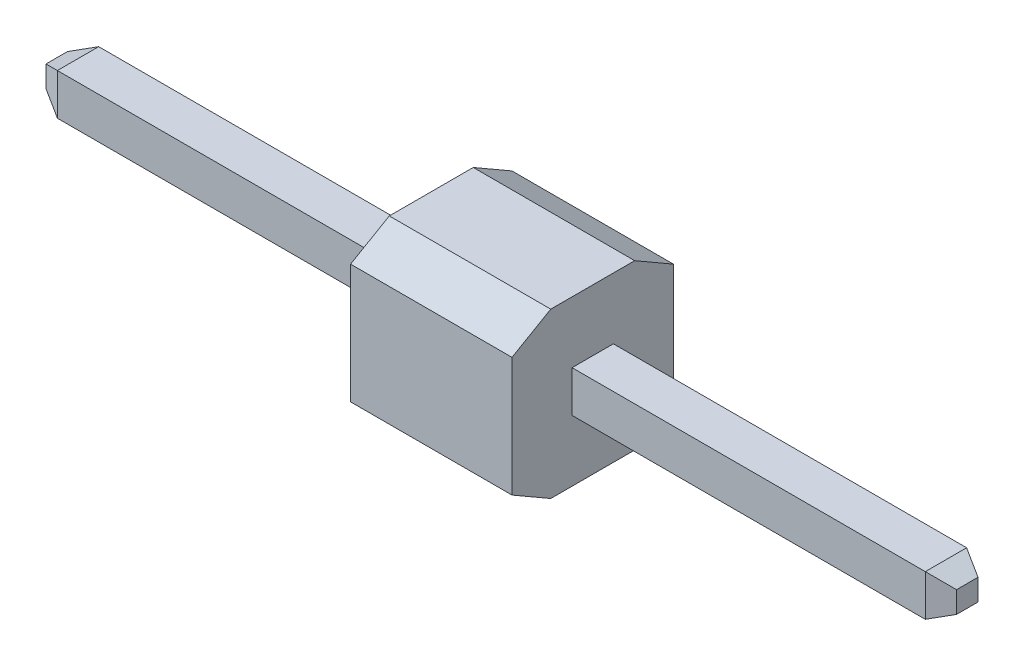
ISO-10303-21;
HEADER;
FILE_DESCRIPTION(('STEP AP214'),'2;1');
FILE_NAME('part.step','',(''),(''),'','','');
FILE_SCHEMA(('AUTOMOTIVE_DESIGN { 1 0 10303 214 1 1 1 1 }'));
ENDSEC;
DATA;
#1=APPLICATION_CONTEXT('core data for automotive mechanical design processes');
#2=APPLICATION_PROTOCOL_DEFINITION('international standard','automotive_design',2000,#1);
#3=PRODUCT_CONTEXT('',#1,'mechanical');
#4=PRODUCT('Part','Part','',(#3));
#5=PRODUCT_RELATED_PRODUCT_CATEGORY('part','',(#4));
#6=PRODUCT_DEFINITION_FORMATION('','',#4);
#7=PRODUCT_DEFINITION_CONTEXT('part definition',#1,'design');
#8=PRODUCT_DEFINITION('design','',#6,#7);
#9=PRODUCT_DEFINITION_SHAPE('','',#8);
#10=(LENGTH_UNIT() NAMED_UNIT(*) SI_UNIT(.MILLI.,.METRE.));
#11=(NAMED_UNIT(*) PLANE_ANGLE_UNIT() SI_UNIT($,.RADIAN.));
#12=(NAMED_UNIT(*) SI_UNIT($,.STERADIAN.) SOLID_ANGLE_UNIT());
#13=UNCERTAINTY_MEASURE_WITH_UNIT(LENGTH_MEASURE(1.E-05),#10,'distance_accuracy_value','');
#14=(GEOMETRIC_REPRESENTATION_CONTEXT(3) GLOBAL_UNCERTAINTY_ASSIGNED_CONTEXT((#13)) GLOBAL_UNIT_ASSIGNED_CONTEXT((#10,
#11,#12)) REPRESENTATION_CONTEXT('',''));
#15=CARTESIAN_POINT('',(0.,0.,0.));
#16=DIRECTION('',(0.,0.,1.));
#17=DIRECTION('',(1.,0.,0.));
#18=AXIS2_PLACEMENT_3D('',#15,#16,#17);
#19=CARTESIAN_POINT('',(5.42105015001378,-0.317128262913911,0.629998634255617));
#20=DIRECTION('',(1.,4.37113882867379E-08,-4.37113882867379E-08));
#21=DIRECTION('',(-4.37113882867379E-08,1.,0.));
#22=AXIS2_PLACEMENT_3D('',#19,#20,#21);
#23=PLANE('',#22);
#24=DIRECTION('',(1.59994777304463E-08,0.500000000000192,0.866025403784328));
#25=VECTOR('',#24,1.);
#26=CARTESIAN_POINT('',(5.42105002702786,0.926461575576084,-0.940001365744382));
#27=LINE('',#26,#25);
#28=CARTESIAN_POINT('',(5.42105002702786,0.926461575576084,-0.940001365744382));
#29=VERTEX_POINT('',#28);
#30=CARTESIAN_POINT('',(5.42105003811263,1.27287173708609,-0.340001365744383));
#31=VERTEX_POINT('',#30);
#32=EDGE_CURVE('E11',#29,#31,#27,.T.);
#33=ORIENTED_EDGE('',*,*,#32,.T.);
#34=DIRECTION('',(4.37113886966664E-08,0.,0.999999999999999));
#35=VECTOR('',#34,1.);
#36=CARTESIAN_POINT('',(5.42105003811263,1.27287173708609,-0.340001365744383));
#37=LINE('',#36,#35);
#38=CARTESIAN_POINT('',(5.42105009493743,1.27287173708609,0.959998634255618));
#39=VERTEX_POINT('',#38);
#40=EDGE_CURVE('E304',#31,#39,#37,.T.);
#41=ORIENTED_EDGE('',*,*,#40,.T.);
#42=DIRECTION('',(5.9710866882576E-08,-0.500000000000187,0.866025403784329));
#43=VECTOR('',#42,1.);
#44=CARTESIAN_POINT('',(5.42105009493743,1.27287173708609,0.959998634255618));
#45=LINE('',#44,#43);
#46=CARTESIAN_POINT('',(5.42105013630633,0.92646157557609,1.55999863425562));
#47=VERTEX_POINT('',#46);
#48=EDGE_CURVE('E296',#39,#47,#45,.T.);
#49=ORIENTED_EDGE('',*,*,#48,.T.);
#50=DIRECTION('',(4.37113884815545E-08,-0.999999999999999,0.));
#51=VECTOR('',#50,1.);
#52=CARTESIAN_POINT('',(5.42105013630633,0.92646157557609,1.55999863425562));
#53=LINE('',#52,#51);
#54=CARTESIAN_POINT('',(5.42105021704912,-0.920718101393911,1.55999863425562));
#55=VERTEX_POINT('',#54);
#56=EDGE_CURVE('E281',#47,#55,#53,.T.);
#57=ORIENTED_EDGE('',*,*,#56,.T.);
#58=DIRECTION('',(1.5999479012306E-08,0.500000000000192,0.866025403784328));
#59=VECTOR('',#58,1.);
#60=CARTESIAN_POINT('',(5.42105020596436,-1.26712826291391,0.959998634255618));
#61=LINE('',#60,#59);
#62=CARTESIAN_POINT('',(5.42105020596436,-1.26712826291391,0.959998634255618));
#63=VERTEX_POINT('',#62);
#64=EDGE_CURVE('E265',#63,#55,#61,.T.);
#65=ORIENTED_EDGE('',*,*,#64,.F.);
#66=DIRECTION('',(4.37113886966664E-08,0.,0.999999999999999));
#67=VECTOR('',#66,1.);
#68=CARTESIAN_POINT('',(5.42105014913955,-1.26712826291391,-0.340001365744383));
#69=LINE('',#68,#67);
#70=CARTESIAN_POINT('',(5.42105014913955,-1.26712826291391,-0.340001365744383));
#71=VERTEX_POINT('',#70);
#72=EDGE_CURVE('E248',#71,#63,#69,.T.);
#73=ORIENTED_EDGE('',*,*,#72,.F.);
#74=DIRECTION('',(5.97108656001699E-08,-0.500000000000189,0.866025403784328));
#75=VECTOR('',#74,1.);
#76=CARTESIAN_POINT('',(5.42105010777065,-0.920718101393916,-0.940001365744382));
#77=LINE('',#76,#75);
#78=CARTESIAN_POINT('',(5.42105010777065,-0.920718101393916,-0.940001365744382));
#79=VERTEX_POINT('',#78);
#80=EDGE_CURVE('E242',#79,#71,#77,.T.);
#81=ORIENTED_EDGE('',*,*,#80,.F.);
#82=DIRECTION('',(4.37113884815545E-08,-0.999999999999999,0.));
#83=VECTOR('',#82,1.);
#84=CARTESIAN_POINT('',(5.42105002702786,0.926461575576084,-0.940001365744382));
#85=LINE('',#84,#83);
#86=EDGE_CURVE('E236',#29,#79,#85,.T.);
#87=ORIENTED_EDGE('',*,*,#86,.F.);
#88=EDGE_LOOP('',(#33,#41,#49,#57,#65,#73,#81,#87));
#89=FACE_BOUND('',#88,.T.);
#90=DIRECTION('',(-4.37113886753159E-08,0.,-0.999999999999999));
#91=VECTOR('',#90,1.);
#92=CARTESIAN_POINT('',(5.42105012203849,0.322871737086087,0.629998634255617));
#93=LINE('',#92,#91);
#94=CARTESIAN_POINT('',(5.42105012203849,0.322871737086087,0.629998634255617));
#95=VERTEX_POINT('',#94);
#96=CARTESIAN_POINT('',(5.4210500940632,0.322871737086086,-0.0100013657443826));
#97=VERTEX_POINT('',#96);
#98=EDGE_CURVE('E302',#95,#97,#93,.T.);
#99=ORIENTED_EDGE('',*,*,#98,.T.);
#100=DIRECTION('',(-4.3711388675316E-08,0.999999999999999,0.));
#101=VECTOR('',#100,1.);
#102=CARTESIAN_POINT('',(5.42105012203849,-0.317128262913913,-0.0100013657443826));
#103=LINE('',#102,#101);
#104=CARTESIAN_POINT('',(5.42105012203849,-0.317128262913913,-0.0100013657443826));
#105=VERTEX_POINT('',#104);
#106=EDGE_CURVE('E293',#105,#97,#103,.T.);
#107=ORIENTED_EDGE('',*,*,#106,.F.);
#108=DIRECTION('',(-4.37113886753159E-08,0.,-0.999999999999999));
#109=VECTOR('',#108,1.);
#110=CARTESIAN_POINT('',(5.42105015001378,-0.317128262913911,0.629998634255617));
#111=LINE('',#110,#109);
#112=CARTESIAN_POINT('',(5.42105015001378,-0.317128262913911,0.629998634255617));
#113=VERTEX_POINT('',#112);
#114=EDGE_CURVE('E278',#113,#105,#111,.T.);
#115=ORIENTED_EDGE('',*,*,#114,.F.);
#116=DIRECTION('',(-4.3711388675316E-08,0.999999999999999,0.));
#117=VECTOR('',#116,1.);
#118=CARTESIAN_POINT('',(5.42105015001378,-0.317128262913911,0.629998634255617));
#119=LINE('',#118,#117);
#120=EDGE_CURVE('E263',#113,#95,#119,.T.);
#121=ORIENTED_EDGE('',*,*,#120,.T.);
#122=EDGE_LOOP('',(#99,#107,#115,#121));
#123=FACE_BOUND('',#122,.T.);
#124=ADVANCED_FACE('F17',(#89,#123),#23,.T.);
#125=CARTESIAN_POINT('',(2.92105015001378,-0.317128372192382,0.629998743534088));
#126=DIRECTION('',(1.,4.37113882867379E-08,-4.37113882867379E-08));
#127=DIRECTION('',(-4.37113882867379E-08,1.,0.));
#128=AXIS2_PLACEMENT_3D('',#125,#126,#127);
#129=PLANE('',#128);
#130=DIRECTION('',(1.59994783714339E-08,0.500000000000192,0.866025403784328));
#131=VECTOR('',#130,1.);
#132=CARTESIAN_POINT('',(2.92105002702786,0.926461466297614,-0.940001256465912));
#133=LINE('',#132,#131);
#134=CARTESIAN_POINT('',(2.92105002702786,0.926461466297614,-0.940001256465912));
#135=VERTEX_POINT('',#134);
#136=CARTESIAN_POINT('',(2.92105003811263,1.27287162780762,-0.340001256465912));
#137=VERTEX_POINT('',#136);
#138=EDGE_CURVE('E24',#135,#137,#133,.T.);
#139=ORIENTED_EDGE('',*,*,#138,.F.);
#140=DIRECTION('',(4.37113882411397E-08,-0.999999999999999,0.));
#141=VECTOR('',#140,1.);
#142=CARTESIAN_POINT('',(2.92105002702786,0.926461466297614,-0.940001256465912));
#143=LINE('',#142,#141);
#144=CARTESIAN_POINT('',(2.92105010777065,-0.920718210672387,-0.940001256465912));
#145=VERTEX_POINT('',#144);
#146=EDGE_CURVE('E300',#135,#145,#143,.T.);
#147=ORIENTED_EDGE('',*,*,#146,.T.);
#148=DIRECTION('',(5.97108668821451E-08,-0.500000000000189,0.866025403784328));
#149=VECTOR('',#148,1.);
#150=CARTESIAN_POINT('',(2.92105010777065,-0.920718210672387,-0.940001256465912));
#151=LINE('',#150,#149);
#152=CARTESIAN_POINT('',(2.92105014913955,-1.26712837219238,-0.340001256465912));
#153=VERTEX_POINT('',#152);
#154=EDGE_CURVE('E286',#145,#153,#151,.T.);
#155=ORIENTED_EDGE('',*,*,#154,.T.);
#156=DIRECTION('',(4.37113883550593E-08,0.,0.999999999999999));
#157=VECTOR('',#156,1.);
#158=CARTESIAN_POINT('',(2.92105014913955,-1.26712837219238,-0.340001256465912));
#159=LINE('',#158,#157);
#160=CARTESIAN_POINT('',(2.92105020596436,-1.26712837219238,0.959998743534088));
#161=VERTEX_POINT('',#160);
#162=EDGE_CURVE('E271',#153,#161,#159,.T.);
#163=ORIENTED_EDGE('',*,*,#162,.T.);
#164=DIRECTION('',(1.59994783713184E-08,0.500000000000192,0.866025403784328));
#165=VECTOR('',#164,1.);
#166=CARTESIAN_POINT('',(2.92105020596436,-1.26712837219238,0.959998743534088));
#167=LINE('',#166,#165);
#168=CARTESIAN_POINT('',(2.92105021704912,-0.920718210672382,1.55999874353409));
#169=VERTEX_POINT('',#168);
#170=EDGE_CURVE('E253',#161,#169,#167,.T.);
#171=ORIENTED_EDGE('',*,*,#170,.T.);
#172=DIRECTION('',(4.37113882411397E-08,-0.999999999999999,0.));
#173=VECTOR('',#172,1.);
#174=CARTESIAN_POINT('',(2.92105013630633,0.926461466297619,1.55999874353409));
#175=LINE('',#174,#173);
#176=CARTESIAN_POINT('',(2.92105013630633,0.926461466297619,1.55999874353409));
#177=VERTEX_POINT('',#176);
#178=EDGE_CURVE('E261',#177,#169,#175,.T.);
#179=ORIENTED_EDGE('',*,*,#178,.F.);
#180=DIRECTION('',(5.9710866882576E-08,-0.500000000000187,0.866025403784329));
#181=VECTOR('',#180,1.);
#182=CARTESIAN_POINT('',(2.92105009493743,1.27287162780762,0.959998743534088));
#183=LINE('',#182,#181);
#184=CARTESIAN_POINT('',(2.92105009493743,1.27287162780762,0.959998743534088));
#185=VERTEX_POINT('',#184);
#186=EDGE_CURVE('E276',#185,#177,#183,.T.);
#187=ORIENTED_EDGE('',*,*,#186,.F.);
#188=DIRECTION('',(4.37113883550593E-08,0.,0.999999999999999));
#189=VECTOR('',#188,1.);
#190=CARTESIAN_POINT('',(2.92105003811263,1.27287162780762,-0.340001256465912));
#191=LINE('',#190,#189);
#192=EDGE_CURVE('E291',#137,#185,#191,.T.);
#193=ORIENTED_EDGE('',*,*,#192,.F.);
#194=EDGE_LOOP('',(#139,#147,#155,#163,#171,#179,#187,#193));
#195=FACE_BOUND('',#194,.T.);
#196=DIRECTION('',(-4.3711388675316E-08,0.999999999999999,0.));
#197=VECTOR('',#196,1.);
#198=CARTESIAN_POINT('',(2.92105012203849,-0.317128372192384,-0.0100012564659119));
#199=LINE('',#198,#197);
#200=CARTESIAN_POINT('',(2.92105012203849,-0.317128372192384,-0.0100012564659119));
#201=VERTEX_POINT('',#200);
#202=CARTESIAN_POINT('',(2.9210500940632,0.322871627807615,-0.0100012564659119));
#203=VERTEX_POINT('',#202);
#204=EDGE_CURVE('E298',#201,#203,#199,.T.);
#205=ORIENTED_EDGE('',*,*,#204,.T.);
#206=DIRECTION('',(-4.37113886753159E-08,0.,-0.999999999999999));
#207=VECTOR('',#206,1.);
#208=CARTESIAN_POINT('',(2.92105012203849,0.322871627807617,0.629998743534088));
#209=LINE('',#208,#207);
#210=CARTESIAN_POINT('',(2.92105012203849,0.322871627807617,0.629998743534088));
#211=VERTEX_POINT('',#210);
#212=EDGE_CURVE('E283',#211,#203,#209,.T.);
#213=ORIENTED_EDGE('',*,*,#212,.F.);
#214=DIRECTION('',(-4.37113879814266E-08,0.999999999999999,0.));
#215=VECTOR('',#214,1.);
#216=CARTESIAN_POINT('',(2.92105015001378,-0.317128372192382,0.629998743534088));
#217=LINE('',#216,#215);
#218=CARTESIAN_POINT('',(2.92105015001378,-0.317128372192382,0.629998743534088));
#219=VERTEX_POINT('',#218);
#220=EDGE_CURVE('E268',#219,#211,#217,.T.);
#221=ORIENTED_EDGE('',*,*,#220,.F.);
#222=DIRECTION('',(-4.37113879814266E-08,0.,-0.999999999999999));
#223=VECTOR('',#222,1.);
#224=CARTESIAN_POINT('',(2.92105015001378,-0.317128372192382,0.629998743534088));
#225=LINE('',#224,#223);
#226=EDGE_CURVE('E251',#219,#201,#225,.T.);
#227=ORIENTED_EDGE('',*,*,#226,.T.);
#228=EDGE_LOOP('',(#205,#213,#221,#227));
#229=FACE_BOUND('',#228,.T.);
#230=ADVANCED_FACE('F314',(#195,#229),#129,.F.);
#231=CARTESIAN_POINT('',(5.42105002702786,0.926461575576084,-0.940001365744382));
#232=DIRECTION('',(5.97108668343731E-08,-0.866025403784328,0.50000000000019));
#233=DIRECTION('',(-1.59994785476185E-08,-0.500000000000192,-0.866025403784329));
#234=AXIS2_PLACEMENT_3D('',#231,#232,#233);
#235=PLANE('',#234);
#236=ORIENTED_EDGE('',*,*,#138,.T.);
#237=DIRECTION('',(-0.999999999999998,-4.37113882867378E-08,4.37113883755557E-08));
#238=VECTOR('',#237,1.);
#239=CARTESIAN_POINT('',(5.42105003811263,1.27287173708609,-0.340001365744383));
#240=LINE('',#239,#238);
#241=EDGE_CURVE('E288',#31,#137,#240,.T.);
#242=ORIENTED_EDGE('',*,*,#241,.F.);
#243=ORIENTED_EDGE('',*,*,#32,.F.);
#244=DIRECTION('',(-0.999999999999998,-4.37113882867378E-08,4.37113881091022E-08));
#245=VECTOR('',#244,1.);
#246=CARTESIAN_POINT('',(5.42105002702786,0.926461575576084,-0.940001365744382));
#247=LINE('',#246,#245);
#248=EDGE_CURVE('E256',#29,#135,#247,.T.);
#249=ORIENTED_EDGE('',*,*,#248,.T.);
#250=EDGE_LOOP('',(#236,#242,#243,#249));
#251=FACE_BOUND('',#250,.T.);
#252=ADVANCED_FACE('F306',(#251),#235,.F.);
#253=CARTESIAN_POINT('',(5.42105003811263,1.27287173708609,-0.340001365744383));
#254=DIRECTION('',(4.37113882867379E-08,-1.,0.));
#255=DIRECTION('',(1.,4.37113882867379E-08,-4.37113882867379E-08));
#256=AXIS2_PLACEMENT_3D('',#253,#254,#255);
#257=PLANE('',#256);
#258=ORIENTED_EDGE('',*,*,#192,.T.);
#259=DIRECTION('',(-0.999999999999998,-4.37113882867378E-08,4.37113882867378E-08));
#260=VECTOR('',#259,1.);
#261=CARTESIAN_POINT('',(5.42105009493743,1.27287173708609,0.959998634255618));
#262=LINE('',#261,#260);
#263=EDGE_CURVE('E273',#39,#185,#262,.T.);
#264=ORIENTED_EDGE('',*,*,#263,.F.);
#265=ORIENTED_EDGE('',*,*,#40,.F.);
#266=ORIENTED_EDGE('',*,*,#241,.T.);
#267=EDGE_LOOP('',(#258,#264,#265,#266));
#268=FACE_BOUND('',#267,.T.);
#269=ADVANCED_FACE('F311',(#268),#257,.F.);
#270=CARTESIAN_POINT('',(5.42105009493743,1.27287173708609,0.959998634255618));
#271=DIRECTION('',(1.59994785476185E-08,-0.86602540378433,-0.50000000000019));
#272=DIRECTION('',(-5.97108668343731E-08,0.500000000000188,-0.866025403784329));
#273=AXIS2_PLACEMENT_3D('',#270,#271,#272);
#274=PLANE('',#273);
#275=ORIENTED_EDGE('',*,*,#186,.T.);
#276=DIRECTION('',(-0.999999999999998,-4.37113882867378E-08,4.37113882867378E-08));
#277=VECTOR('',#276,1.);
#278=CARTESIAN_POINT('',(5.42105013630633,0.92646157557609,1.55999863425562));
#279=LINE('',#278,#277);
#280=EDGE_CURVE('E258',#47,#177,#279,.T.);
#281=ORIENTED_EDGE('',*,*,#280,.F.);
#282=ORIENTED_EDGE('',*,*,#48,.F.);
#283=ORIENTED_EDGE('',*,*,#263,.T.);
#284=EDGE_LOOP('',(#275,#281,#282,#283));
#285=FACE_BOUND('',#284,.T.);
#286=ADVANCED_FACE('F319',(#285),#274,.F.);
#287=CARTESIAN_POINT('',(5.42105013630633,0.92646157557609,1.55999863425562));
#288=DIRECTION('',(-4.37113882867379E-08,0.,-1.));
#289=DIRECTION('',(-1.,-4.37113882867379E-08,4.37113882867379E-08));
#290=AXIS2_PLACEMENT_3D('',#287,#288,#289);
#291=PLANE('',#290);
#292=ORIENTED_EDGE('',*,*,#178,.T.);
#293=DIRECTION('',(-0.999999999999998,-4.37113897078233E-08,4.37113882867378E-08));
#294=VECTOR('',#293,1.);
#295=CARTESIAN_POINT('',(5.42105021704912,-0.920718101393911,1.55999863425562));
#296=LINE('',#295,#294);
#297=EDGE_CURVE('E245',#55,#169,#296,.T.);
#298=ORIENTED_EDGE('',*,*,#297,.F.);
#299=ORIENTED_EDGE('',*,*,#56,.F.);
#300=ORIENTED_EDGE('',*,*,#280,.T.);
#301=EDGE_LOOP('',(#292,#298,#299,#300));
#302=FACE_BOUND('',#301,.T.);
#303=ADVANCED_FACE('F326',(#302),#291,.F.);
#304=CARTESIAN_POINT('',(5.42105020596436,-1.26712826291391,0.959998634255618));
#305=DIRECTION('',(5.97108668343731E-08,-0.866025403784328,0.50000000000019));
#306=DIRECTION('',(-1.59994785476185E-08,-0.500000000000192,-0.866025403784329));
#307=AXIS2_PLACEMENT_3D('',#304,#305,#306);
#308=PLANE('',#307);
#309=ORIENTED_EDGE('',*,*,#170,.F.);
#310=DIRECTION('',(-0.999999999999998,-4.37113875761951E-08,4.37113882867378E-08));
#311=VECTOR('',#310,1.);
#312=CARTESIAN_POINT('',(5.42105020596436,-1.26712826291391,0.959998634255618));
#313=LINE('',#312,#311);
#314=EDGE_CURVE('E239',#63,#161,#313,.T.);
#315=ORIENTED_EDGE('',*,*,#314,.F.);
#316=ORIENTED_EDGE('',*,*,#64,.T.);
#317=ORIENTED_EDGE('',*,*,#297,.T.);
#318=EDGE_LOOP('',(#309,#315,#316,#317));
#319=FACE_BOUND('',#318,.T.);
#320=ADVANCED_FACE('F329',(#319),#308,.T.);
#321=CARTESIAN_POINT('',(5.42105014913955,-1.26712826291391,-0.340001365744383));
#322=DIRECTION('',(4.37113882867379E-08,-1.,0.));
#323=DIRECTION('',(1.,4.37113882867379E-08,-4.37113882867379E-08));
#324=AXIS2_PLACEMENT_3D('',#321,#322,#323);
#325=PLANE('',#324);
#326=ORIENTED_EDGE('',*,*,#162,.F.);
#327=DIRECTION('',(-0.999999999999998,-4.37113875761951E-08,4.37113883755557E-08));
#328=VECTOR('',#327,1.);
#329=CARTESIAN_POINT('',(5.42105014913955,-1.26712826291391,-0.340001365744383));
#330=LINE('',#329,#328);
#331=EDGE_CURVE('E233',#71,#153,#330,.T.);
#332=ORIENTED_EDGE('',*,*,#331,.F.);
#333=ORIENTED_EDGE('',*,*,#72,.T.);
#334=ORIENTED_EDGE('',*,*,#314,.T.);
#335=EDGE_LOOP('',(#326,#332,#333,#334));
#336=FACE_BOUND('',#335,.T.);
#337=ADVANCED_FACE('F333',(#336),#325,.T.);
#338=CARTESIAN_POINT('',(5.42105010777065,-0.920718101393916,-0.940001365744382));
#339=DIRECTION('',(1.59994785476185E-08,-0.86602540378433,-0.50000000000019));
#340=DIRECTION('',(-5.97108668343731E-08,0.500000000000188,-0.866025403784329));
#341=AXIS2_PLACEMENT_3D('',#338,#339,#340);
#342=PLANE('',#341);
#343=ORIENTED_EDGE('',*,*,#154,.F.);
#344=DIRECTION('',(-0.999999999999998,-4.37113897078233E-08,4.37113881091021E-08));
#345=VECTOR('',#344,1.);
#346=CARTESIAN_POINT('',(5.42105010777065,-0.920718101393916,-0.940001365744382));
#347=LINE('',#346,#345);
#348=EDGE_CURVE('E230',#79,#145,#347,.T.);
#349=ORIENTED_EDGE('',*,*,#348,.F.);
#350=ORIENTED_EDGE('',*,*,#80,.T.);
#351=ORIENTED_EDGE('',*,*,#331,.T.);
#352=EDGE_LOOP('',(#343,#349,#350,#351));
#353=FACE_BOUND('',#352,.T.);
#354=ADVANCED_FACE('F337',(#353),#342,.T.);
#355=CARTESIAN_POINT('',(5.42105002702786,0.926461575576084,-0.940001365744382));
#356=DIRECTION('',(-4.37113882867379E-08,0.,-1.));
#357=DIRECTION('',(-4.37113882867379E-08,1.,0.));
#358=AXIS2_PLACEMENT_3D('',#355,#356,#357);
#359=PLANE('',#358);
#360=ORIENTED_EDGE('',*,*,#146,.F.);
#361=ORIENTED_EDGE('',*,*,#248,.F.);
#362=ORIENTED_EDGE('',*,*,#86,.T.);
#363=ORIENTED_EDGE('',*,*,#348,.T.);
#364=EDGE_LOOP('',(#360,#361,#362,#363));
#365=FACE_BOUND('',#364,.T.);
#366=ADVANCED_FACE('F339',(#365),#359,.T.);
#367=CARTESIAN_POINT('',(-2.87894984998622,-0.317128625718434,0.62999899706014));
#368=DIRECTION('',(-1.,-4.37113882867379E-08,4.37113882867379E-08));
#369=DIRECTION('',(4.37113882867379E-08,-1.,0.));
#370=AXIS2_PLACEMENT_3D('',#367,#368,#369);
#371=PLANE('',#370);
#372=DIRECTION('',(4.37113900757526E-08,-0.999999999999999,0.));
#373=VECTOR('',#372,1.);
#374=CARTESIAN_POINT('',(-2.87894989248405,0.168989847091563,0.14388052425114));
#375=LINE('',#374,#373);
#376=CARTESIAN_POINT('',(-2.87894989248404,0.168989847091563,0.14388052425114));
#377=VERTEX_POINT('',#376);
#378=CARTESIAN_POINT('',(-2.87894987796151,-0.163247098518436,0.14388052425114));
#379=VERTEX_POINT('',#378);
#380=EDGE_CURVE('E228',#377,#379,#375,.T.);
#381=ORIENTED_EDGE('',*,*,#380,.T.);
#382=DIRECTION('',(4.37113874013716E-08,0.,0.999999999999999));
#383=VECTOR('',#382,1.);
#384=CARTESIAN_POINT('',(-2.87894987796151,-0.163247098518436,0.14388052425114));
#385=LINE('',#384,#383);
#386=CARTESIAN_POINT('',(-2.87894986343897,-0.163247098518434,0.47611746986914));
#387=VERTEX_POINT('',#386);
#388=EDGE_CURVE('E223',#379,#387,#385,.T.);
#389=ORIENTED_EDGE('',*,*,#388,.T.);
#390=DIRECTION('',(-4.37113847290958E-08,0.999999999999999,0.));
#391=VECTOR('',#390,1.);
#392=CARTESIAN_POINT('',(-2.87894986343897,-0.163247098518436,0.47611746986914));
#393=LINE('',#392,#391);
#394=CARTESIAN_POINT('',(-2.87894987796151,0.168989847091565,0.47611746986914));
#395=VERTEX_POINT('',#394);
#396=EDGE_CURVE('E215',#387,#395,#393,.T.);
#397=ORIENTED_EDGE('',*,*,#396,.T.);
#398=DIRECTION('',(-4.37113820547151E-08,0.,-0.999999999999999));
#399=VECTOR('',#398,1.);
#400=CARTESIAN_POINT('',(-2.87894987796151,0.168989847091565,0.47611746986914));
#401=LINE('',#400,#399);
#402=EDGE_CURVE('E207',#395,#377,#401,.T.);
#403=ORIENTED_EDGE('',*,*,#402,.T.);
#404=EDGE_LOOP('',(#381,#389,#397,#403));
#405=FACE_BOUND('',#404,.T.);
#406=ADVANCED_FACE('F341',(#405),#371,.T.);
#407=CARTESIAN_POINT('',(-2.87894984998622,-0.317128625718434,0.62999899706014));
#408=DIRECTION('',(4.37113882867379E-08,-1.,0.));
#409=DIRECTION('',(-4.37113882867379E-08,0.,-1.));
#410=AXIS2_PLACEMENT_3D('',#407,#408,#409);
#411=PLANE('',#410);
#412=DIRECTION('',(0.999999999999998,4.37113875463186E-08,-4.37113882769955E-08));
#413=VECTOR('',#412,1.);
#414=CARTESIAN_POINT('',(-2.54894984998622,-0.317128611293676,0.629998982635382));
#415=LINE('',#414,#413);
#416=CARTESIAN_POINT('',(-2.54894984998622,-0.317128611293676,0.629998982635382));
#417=VERTEX_POINT('',#416);
#418=EDGE_CURVE('E225',#417,#219,#415,.T.);
#419=ORIENTED_EDGE('',*,*,#418,.F.);
#420=DIRECTION('',(-4.37113886753159E-08,0.,-0.999999999999999));
#421=VECTOR('',#420,1.);
#422=CARTESIAN_POINT('',(-2.54894984998622,-0.317128611293676,0.629998982635382));
#423=LINE('',#422,#421);
#424=CARTESIAN_POINT('',(-2.54894987796151,-0.317128611293677,-0.010001017364618));
#425=VERTEX_POINT('',#424);
#426=EDGE_CURVE('E217',#417,#425,#423,.T.);
#427=ORIENTED_EDGE('',*,*,#426,.T.);
#428=DIRECTION('',(0.999999999999998,4.37113875463185E-08,-4.37113882161057E-08));
#429=VECTOR('',#428,1.);
#430=CARTESIAN_POINT('',(-2.54894987796151,-0.317128611293677,-0.010001017364618));
#431=LINE('',#430,#429);
#432=EDGE_CURVE('E220',#425,#201,#431,.T.);
#433=ORIENTED_EDGE('',*,*,#432,.T.);
#434=ORIENTED_EDGE('',*,*,#226,.F.);
#435=EDGE_LOOP('',(#419,#427,#433,#434));
#436=FACE_BOUND('',#435,.T.);
#437=ADVANCED_FACE('F348',(#436),#411,.T.);
#438=CARTESIAN_POINT('',(-2.87894987796151,-0.317128625718436,-0.0100010029398598));
#439=DIRECTION('',(-4.37113882867379E-08,0.,-1.));
#440=DIRECTION('',(-1.,-4.37113882867379E-08,4.37113882867379E-08));
#441=AXIS2_PLACEMENT_3D('',#438,#439,#440);
#442=PLANE('',#441);
#443=ORIENTED_EDGE('',*,*,#432,.F.);
#444=DIRECTION('',(-4.3711388675316E-08,0.999999999999999,0.));
#445=VECTOR('',#444,1.);
#446=CARTESIAN_POINT('',(-2.54894987796151,-0.317128611293677,-0.010001017364618));
#447=LINE('',#446,#445);
#448=CARTESIAN_POINT('',(-2.5489499059368,0.322871388706321,-0.010001017364618));
#449=VERTEX_POINT('',#448);
#450=EDGE_CURVE('E209',#425,#449,#447,.T.);
#451=ORIENTED_EDGE('',*,*,#450,.T.);
#452=DIRECTION('',(0.999999999999998,4.37113865720826E-08,-4.37113882161057E-08));
#453=VECTOR('',#452,1.);
#454=CARTESIAN_POINT('',(-2.5489499059368,0.322871388706321,-0.010001017364618));
#455=LINE('',#454,#453);
#456=EDGE_CURVE('E212',#449,#203,#455,.T.);
#457=ORIENTED_EDGE('',*,*,#456,.T.);
#458=ORIENTED_EDGE('',*,*,#204,.F.);
#459=EDGE_LOOP('',(#443,#451,#457,#458));
#460=FACE_BOUND('',#459,.T.);
#461=ADVANCED_FACE('F424',(#460),#442,.T.);
#462=CARTESIAN_POINT('',(-2.87894987796151,0.322871374281565,0.62999899706014));
#463=DIRECTION('',(4.37113882867379E-08,-1.,0.));
#464=DIRECTION('',(-4.37113882867379E-08,0.,-1.));
#465=AXIS2_PLACEMENT_3D('',#462,#463,#464);
#466=PLANE('',#465);
#467=ORIENTED_EDGE('',*,*,#456,.F.);
#468=DIRECTION('',(4.37113900630947E-08,0.,0.999999999999999));
#469=VECTOR('',#468,1.);
#470=CARTESIAN_POINT('',(-2.5489499059368,0.322871388706321,-0.010001017364618));
#471=LINE('',#470,#469);
#472=CARTESIAN_POINT('',(-2.54894987796151,0.322871388706323,0.629998982635382));
#473=VERTEX_POINT('',#472);
#474=EDGE_CURVE('E201',#449,#473,#471,.T.);
#475=ORIENTED_EDGE('',*,*,#474,.T.);
#476=DIRECTION('',(0.999999999999998,4.37113865720826E-08,-4.37113882769955E-08));
#477=VECTOR('',#476,1.);
#478=CARTESIAN_POINT('',(-2.54894987796151,0.322871388706323,0.629998982635382));
#479=LINE('',#478,#477);
#480=EDGE_CURVE('E204',#473,#211,#479,.T.);
#481=ORIENTED_EDGE('',*,*,#480,.T.);
#482=ORIENTED_EDGE('',*,*,#212,.T.);
#483=EDGE_LOOP('',(#467,#475,#481,#482));
#484=FACE_BOUND('',#483,.T.);
#485=ADVANCED_FACE('F421',(#484),#466,.F.);
#486=CARTESIAN_POINT('',(-2.87894984998622,-0.317128625718434,0.62999899706014));
#487=DIRECTION('',(-4.37113882867379E-08,0.,-1.));
#488=DIRECTION('',(-1.,-4.37113882867379E-08,4.37113882867379E-08));
#489=AXIS2_PLACEMENT_3D('',#486,#487,#488);
#490=PLANE('',#489);
#491=ORIENTED_EDGE('',*,*,#480,.F.);
#492=DIRECTION('',(4.37113900630949E-08,-0.999999999999999,0.));
#493=VECTOR('',#492,1.);
#494=CARTESIAN_POINT('',(-2.54894987796151,0.322871388706321,0.629998982635382));
#495=LINE('',#494,#493);
#496=EDGE_CURVE('E196',#473,#417,#495,.T.);
#497=ORIENTED_EDGE('',*,*,#496,.T.);
#498=ORIENTED_EDGE('',*,*,#418,.T.);
#499=ORIENTED_EDGE('',*,*,#220,.T.);
#500=EDGE_LOOP('',(#491,#497,#498,#499));
#501=FACE_BOUND('',#500,.T.);
#502=ADVANCED_FACE('F376',(#501),#490,.F.);
#503=CARTESIAN_POINT('',(-2.87894984998622,-0.317128625718434,0.62999899706014));
#504=DIRECTION('',(-4.37113882867379E-08,0.,-1.));
#505=DIRECTION('',(-1.,-4.37113882867379E-08,4.37113882867379E-08));
#506=AXIS2_PLACEMENT_3D('',#503,#504,#505);
#507=PLANE('',#506);
#508=DIRECTION('',(0.999999999999998,4.37113829998842E-08,-4.37113882769955E-08));
#509=VECTOR('',#508,1.);
#510=CARTESIAN_POINT('',(5.42105015001378,-0.317128262913901,0.629998634255617));
#511=LINE('',#510,#509);
#512=CARTESIAN_POINT('',(10.8910501500138,-0.317128023812618,0.629998395154324));
#513=VERTEX_POINT('',#512);
#514=EDGE_CURVE('E199',#113,#513,#511,.T.);
#515=ORIENTED_EDGE('',*,*,#514,.T.);
#516=DIRECTION('',(-4.37113900630948E-08,0.999999999999999,0.));
#517=VECTOR('',#516,1.);
#518=CARTESIAN_POINT('',(10.8910501500138,-0.317128023812618,0.629998395154324));
#519=LINE('',#518,#517);
#520=CARTESIAN_POINT('',(10.8910501220385,0.322871976187381,0.629998395154324));
#521=VERTEX_POINT('',#520);
#522=EDGE_CURVE('E191',#513,#521,#519,.T.);
#523=ORIENTED_EDGE('',*,*,#522,.T.);
#524=DIRECTION('',(0.999999999999998,4.37113881958092E-08,-4.37113882769955E-08));
#525=VECTOR('',#524,1.);
#526=CARTESIAN_POINT('',(5.42105012203849,0.322871737086086,0.629998634255617));
#527=LINE('',#526,#525);
#528=EDGE_CURVE('E194',#95,#521,#527,.T.);
#529=ORIENTED_EDGE('',*,*,#528,.F.);
#530=ORIENTED_EDGE('',*,*,#120,.F.);
#531=EDGE_LOOP('',(#515,#523,#529,#530));
#532=FACE_BOUND('',#531,.T.);
#533=ADVANCED_FACE('F367',(#532),#507,.F.);
#534=CARTESIAN_POINT('',(-2.87894987796151,0.322871374281565,0.62999899706014));
#535=DIRECTION('',(4.37113882867379E-08,-1.,0.));
#536=DIRECTION('',(-4.37113882867379E-08,0.,-1.));
#537=AXIS2_PLACEMENT_3D('',#534,#535,#536);
#538=PLANE('',#537);
#539=ORIENTED_EDGE('',*,*,#528,.T.);
#540=DIRECTION('',(-4.37113900630947E-08,0.,-0.999999999999999));
#541=VECTOR('',#540,1.);
#542=CARTESIAN_POINT('',(10.8910501220385,0.322871976187381,0.629998395154324));
#543=LINE('',#542,#541);
#544=CARTESIAN_POINT('',(10.8910500940632,0.322871976187379,-0.0100016048456765));
#545=VERTEX_POINT('',#544);
#546=EDGE_CURVE('E186',#521,#545,#543,.T.);
#547=ORIENTED_EDGE('',*,*,#546,.T.);
#548=DIRECTION('',(0.999999999999998,4.37113881958092E-08,-4.37113881146228E-08));
#549=VECTOR('',#548,1.);
#550=CARTESIAN_POINT('',(5.4210500940632,0.322871737086084,-0.0100013657443823));
#551=LINE('',#550,#549);
#552=EDGE_CURVE('E189',#97,#545,#551,.T.);
#553=ORIENTED_EDGE('',*,*,#552,.F.);
#554=ORIENTED_EDGE('',*,*,#98,.F.);
#555=EDGE_LOOP('',(#539,#547,#553,#554));
#556=FACE_BOUND('',#555,.T.);
#557=ADVANCED_FACE('F364',(#556),#538,.F.);
#558=CARTESIAN_POINT('',(-2.87894987796151,-0.317128625718436,-0.0100010029398598));
#559=DIRECTION('',(-4.37113882867379E-08,0.,-1.));
#560=DIRECTION('',(-1.,-4.37113882867379E-08,4.37113882867379E-08));
#561=AXIS2_PLACEMENT_3D('',#558,#559,#560);
#562=PLANE('',#561);
#563=ORIENTED_EDGE('',*,*,#552,.T.);
#564=DIRECTION('',(4.37113900630949E-08,-0.999999999999999,0.));
#565=VECTOR('',#564,1.);
#566=CARTESIAN_POINT('',(10.8910500940632,0.322871976187377,-0.0100016048456764));
#567=LINE('',#566,#565);
#568=CARTESIAN_POINT('',(10.8910501220385,-0.31712802381262,-0.0100016048456765));
#569=VERTEX_POINT('',#568);
#570=EDGE_CURVE('E176',#545,#569,#567,.T.);
#571=ORIENTED_EDGE('',*,*,#570,.T.);
#572=DIRECTION('',(0.999999999999998,4.37113829998842E-08,-4.37113881146228E-08));
#573=VECTOR('',#572,1.);
#574=CARTESIAN_POINT('',(5.42105012203849,-0.317128262913903,-0.0100013657443823));
#575=LINE('',#574,#573);
#576=EDGE_CURVE('E179',#105,#569,#575,.T.);
#577=ORIENTED_EDGE('',*,*,#576,.F.);
#578=ORIENTED_EDGE('',*,*,#106,.T.);
#579=EDGE_LOOP('',(#563,#571,#577,#578));
#580=FACE_BOUND('',#579,.T.);
#581=ADVANCED_FACE('F366',(#580),#562,.T.);
#582=CARTESIAN_POINT('',(-2.87894984998622,-0.317128625718434,0.62999899706014));
#583=DIRECTION('',(4.37113882867379E-08,-1.,0.));
#584=DIRECTION('',(-4.37113882867379E-08,0.,-1.));
#585=AXIS2_PLACEMENT_3D('',#582,#583,#584);
#586=PLANE('',#585);
#587=ORIENTED_EDGE('',*,*,#576,.T.);
#588=DIRECTION('',(4.37113900630947E-08,0.,0.999999999999999));
#589=VECTOR('',#588,1.);
#590=CARTESIAN_POINT('',(10.8910501220385,-0.31712802381262,-0.0100016048456765));
#591=LINE('',#590,#589);
#592=EDGE_CURVE('E167',#569,#513,#591,.T.);
#593=ORIENTED_EDGE('',*,*,#592,.T.);
#594=ORIENTED_EDGE('',*,*,#514,.F.);
#595=ORIENTED_EDGE('',*,*,#114,.T.);
#596=EDGE_LOOP('',(#587,#593,#594,#595));
#597=FACE_BOUND('',#596,.T.);
#598=ADVANCED_FACE('F373',(#597),#586,.T.);
#599=CARTESIAN_POINT('',(11.2210501500138,-0.31712800938786,0.629998380729565));
#600=DIRECTION('',(-1.,-4.37113882867379E-08,4.37113882867379E-08));
#601=DIRECTION('',(4.37113882867379E-08,-1.,0.));
#602=AXIS2_PLACEMENT_3D('',#599,#600,#601);
#603=PLANE('',#602);
#604=DIRECTION('',(-4.3711387402424E-08,0.999999999999999,0.));
#605=VECTOR('',#604,1.);
#606=CARTESIAN_POINT('',(11.2210501220385,-0.163246482187864,0.143879907920565));
#607=LINE('',#606,#605);
#608=CARTESIAN_POINT('',(11.2210501220385,-0.163246482187862,0.143879907920565));
#609=VERTEX_POINT('',#608);
#610=CARTESIAN_POINT('',(11.221050107516,0.168990463422137,0.143879907920565));
#611=VERTEX_POINT('',#610);
#612=EDGE_CURVE('E153',#609,#611,#607,.T.);
#613=ORIENTED_EDGE('',*,*,#612,.T.);
#614=DIRECTION('',(4.37113874013716E-08,0.,0.999999999999999));
#615=VECTOR('',#614,1.);
#616=CARTESIAN_POINT('',(11.221050107516,0.168990463422137,0.143879907920565));
#617=LINE('',#616,#615);
#618=CARTESIAN_POINT('',(11.2210501220385,0.168990463422139,0.476116853538565));
#619=VERTEX_POINT('',#618);
#620=EDGE_CURVE('E395',#611,#619,#617,.T.);
#621=ORIENTED_EDGE('',*,*,#620,.T.);
#622=DIRECTION('',(4.37113927490808E-08,-0.999999999999999,0.));
#623=VECTOR('',#622,1.);
#624=CARTESIAN_POINT('',(11.2210501220385,0.168990463422139,0.476116853538565));
#625=LINE('',#624,#623);
#626=CARTESIAN_POINT('',(11.221050136561,-0.16324648218786,0.476116853538565));
#627=VERTEX_POINT('',#626);
#628=EDGE_CURVE('E156',#619,#627,#625,.T.);
#629=ORIENTED_EDGE('',*,*,#628,.T.);
#630=DIRECTION('',(-4.37113980946847E-08,0.,-0.999999999999999));
#631=VECTOR('',#630,1.);
#632=CARTESIAN_POINT('',(11.221050136561,-0.16324648218786,0.476116853538565));
#633=LINE('',#632,#631);
#634=EDGE_CURVE('E149',#627,#609,#633,.T.);
#635=ORIENTED_EDGE('',*,*,#634,.T.);
#636=EDGE_LOOP('',(#613,#621,#629,#635));
#637=FACE_BOUND('',#636,.T.);
#638=ADVANCED_FACE('F151',(#637),#603,.F.);
#639=CARTESIAN_POINT('',(-2.87894987123513,0.168989847091565,0.62999899706014));
#640=DIRECTION('',(-0.422618301356784,0.906307768563367,1.84732310895534E-08));
#641=DIRECTION('',(4.37113882867379E-08,0.,1.));
#642=AXIS2_PLACEMENT_3D('',#639,#640,#641);
#643=PLANE('',#642);
#644=DIRECTION('',(0.834817095446926,0.389281657126017,-0.389281657126019));
#645=VECTOR('',#644,1.);
#646=CARTESIAN_POINT('',(-2.87894989248406,0.168989847092082,0.143880524251623));
#647=LINE('',#646,#645);
#648=EDGE_CURVE('E181',#377,#449,#647,.T.);
#649=ORIENTED_EDGE('',*,*,#648,.F.);
#650=ORIENTED_EDGE('',*,*,#402,.F.);
#651=DIRECTION('',(-0.834817129479006,-0.389281657126019,-0.389281584143989));
#652=VECTOR('',#651,1.);
#653=CARTESIAN_POINT('',(-2.54894987796194,0.322871388707785,0.629998982634844));
#654=LINE('',#653,#652);
#655=EDGE_CURVE('E404',#473,#395,#654,.T.);
#656=ORIENTED_EDGE('',*,*,#655,.F.);
#657=ORIENTED_EDGE('',*,*,#474,.F.);
#658=EDGE_LOOP('',(#649,#650,#656,#657));
#659=FACE_BOUND('',#658,.T.);
#660=ADVANCED_FACE('F418',(#659),#643,.T.);
#661=CARTESIAN_POINT('',(-2.87894985671259,-0.317128625718434,0.47611746986914));
#662=DIRECTION('',(-0.422618222124841,-1.84732292043498E-08,0.906307805509828));
#663=DIRECTION('',(4.37113882867379E-08,-1.,0.));
#664=AXIS2_PLACEMENT_3D('',#661,#662,#663);
#665=PLANE('',#664);
#666=ORIENTED_EDGE('',*,*,#655,.T.);
#667=ORIENTED_EDGE('',*,*,#396,.F.);
#668=DIRECTION('',(-0.834817163511086,0.389281584143988,-0.389281584143986));
#669=VECTOR('',#668,1.);
#670=CARTESIAN_POINT('',(-2.54894984998507,-0.317128611290949,0.629998982635653));
#671=LINE('',#670,#669);
#672=EDGE_CURVE('E160',#417,#387,#671,.T.);
#673=ORIENTED_EDGE('',*,*,#672,.F.);
#674=ORIENTED_EDGE('',*,*,#496,.F.);
#675=EDGE_LOOP('',(#666,#667,#673,#674));
#676=FACE_BOUND('',#675,.T.);
#677=ADVANCED_FACE('F434',(#676),#665,.T.);
#678=CARTESIAN_POINT('',(-2.54894987796151,-0.317128611293677,-0.010001017364618));
#679=DIRECTION('',(0.422618301356784,1.8473232667688E-08,0.906307768563367));
#680=DIRECTION('',(-4.37113882867379E-08,1.,0.));
#681=AXIS2_PLACEMENT_3D('',#678,#679,#680);
#682=PLANE('',#681);
#683=ORIENTED_EDGE('',*,*,#648,.T.);
#684=ORIENTED_EDGE('',*,*,#450,.F.);
#685=DIRECTION('',(0.834817129479007,-0.389281584143989,-0.389281657126018));
#686=VECTOR('',#685,1.);
#687=CARTESIAN_POINT('',(-2.87894987796434,-0.163247098525975,0.1438805242526));
#688=LINE('',#687,#686);
#689=EDGE_CURVE('E170',#379,#425,#688,.T.);
#690=ORIENTED_EDGE('',*,*,#689,.F.);
#691=ORIENTED_EDGE('',*,*,#380,.F.);
#692=EDGE_LOOP('',(#683,#684,#690,#691));
#693=FACE_BOUND('',#692,.T.);
#694=ADVANCED_FACE('F413',(#693),#682,.F.);
#695=CARTESIAN_POINT('',(-2.54894984998622,-0.317128611293676,0.629998982635382));
#696=DIRECTION('',(0.422618222124841,0.906307805509828,-1.84732308250282E-08));
#697=DIRECTION('',(-4.37113882867379E-08,0.,-1.));
#698=AXIS2_PLACEMENT_3D('',#695,#696,#697);
#699=PLANE('',#698);
#700=ORIENTED_EDGE('',*,*,#672,.T.);
#701=ORIENTED_EDGE('',*,*,#388,.F.);
#702=ORIENTED_EDGE('',*,*,#689,.T.);
#703=ORIENTED_EDGE('',*,*,#426,.F.);
#704=EDGE_LOOP('',(#700,#701,#702,#703));
#705=FACE_BOUND('',#704,.T.);
#706=ADVANCED_FACE('F429',(#705),#699,.F.);
#707=CARTESIAN_POINT('',(11.2210501432874,-0.16324648218786,0.629998380729565));
#708=DIRECTION('',(0.422618301356784,-0.906307768563367,-1.84732310470096E-08));
#709=DIRECTION('',(4.37113882867379E-08,0.,1.));
#710=AXIS2_PLACEMENT_3D('',#707,#708,#709);
#711=PLANE('',#710);
#712=DIRECTION('',(-0.834817129479005,-0.389281657126019,-0.38928158414399));
#713=VECTOR('',#712,1.);
#714=CARTESIAN_POINT('',(11.2210501220385,-0.163246482188381,0.143879907921048));
#715=LINE('',#714,#713);
#716=EDGE_CURVE('E164',#609,#569,#715,.T.);
#717=ORIENTED_EDGE('',*,*,#716,.F.);
#718=ORIENTED_EDGE('',*,*,#634,.F.);
#719=DIRECTION('',(0.834817095446925,0.389281657126021,-0.389281657126019));
#720=VECTOR('',#719,1.);
#721=CARTESIAN_POINT('',(10.8910501500138,-0.317128023812618,0.629998395154324));
#722=LINE('',#721,#720);
#723=EDGE_CURVE('E392',#513,#627,#722,.T.);
#724=ORIENTED_EDGE('',*,*,#723,.F.);
#725=ORIENTED_EDGE('',*,*,#592,.F.);
#726=EDGE_LOOP('',(#717,#718,#724,#725));
#727=FACE_BOUND('',#726,.T.);
#728=ADVANCED_FACE('F165',(#727),#711,.T.);
#729=CARTESIAN_POINT('',(10.8910501500138,-0.317128023812618,0.629998395154324));
#730=DIRECTION('',(-0.422618301356784,-1.8473232667688E-08,-0.906307768563367));
#731=DIRECTION('',(-4.37113882867379E-08,1.,0.));
#732=AXIS2_PLACEMENT_3D('',#729,#730,#731);
#733=PLANE('',#732);
#734=ORIENTED_EDGE('',*,*,#723,.T.);
#735=ORIENTED_EDGE('',*,*,#628,.F.);
#736=DIRECTION('',(0.834817129479007,-0.389281584143985,-0.38928165712602));
#737=VECTOR('',#736,1.);
#738=CARTESIAN_POINT('',(10.89105012204,0.322871976191589,0.629998395153421));
#739=LINE('',#738,#737);
#740=EDGE_CURVE('E389',#521,#619,#739,.T.);
#741=ORIENTED_EDGE('',*,*,#740,.F.);
#742=ORIENTED_EDGE('',*,*,#522,.F.);
#743=EDGE_LOOP('',(#734,#735,#741,#742));
#744=FACE_BOUND('',#743,.T.);
#745=ADVANCED_FACE('F390',(#744),#733,.F.);
#746=CARTESIAN_POINT('',(11.2210501287649,-0.317128009387861,0.143879907920565));
#747=DIRECTION('',(0.422618222124841,1.84732292043498E-08,-0.906307805509828));
#748=DIRECTION('',(4.37113882867379E-08,-1.,0.));
#749=AXIS2_PLACEMENT_3D('',#746,#747,#748);
#750=PLANE('',#749);
#751=ORIENTED_EDGE('',*,*,#716,.T.);
#752=ORIENTED_EDGE('',*,*,#570,.F.);
#753=DIRECTION('',(-0.834817163511085,0.389281584143989,-0.389281584143987));
#754=VECTOR('',#753,1.);
#755=CARTESIAN_POINT('',(11.221050107516,0.168990463422654,0.143879907921048));
#756=LINE('',#755,#754);
#757=EDGE_CURVE('E175',#611,#545,#756,.T.);
#758=ORIENTED_EDGE('',*,*,#757,.F.);
#759=ORIENTED_EDGE('',*,*,#612,.F.);
#760=EDGE_LOOP('',(#751,#752,#758,#759));
#761=FACE_BOUND('',#760,.T.);
#762=ADVANCED_FACE('F173',(#761),#750,.T.);
#763=CARTESIAN_POINT('',(10.8910501220385,0.322871976187381,0.629998395154324));
#764=DIRECTION('',(-0.422618222124841,-0.906307805509828,1.84732307824844E-08));
#765=DIRECTION('',(-4.37113882867379E-08,0.,-1.));
#766=AXIS2_PLACEMENT_3D('',#763,#764,#765);
#767=PLANE('',#766);
#768=ORIENTED_EDGE('',*,*,#740,.T.);
#769=ORIENTED_EDGE('',*,*,#620,.F.);
#770=ORIENTED_EDGE('',*,*,#757,.T.);
#771=ORIENTED_EDGE('',*,*,#546,.F.);
#772=EDGE_LOOP('',(#768,#769,#770,#771));
#773=FACE_BOUND('',#772,.T.);
#774=ADVANCED_FACE('F394',(#773),#767,.F.);
#775=CLOSED_SHELL('',(#124,#230,#252,#269,#286,#303,#320,#337,#354,#366,#406,#437,#461,#485,
#502,#533,#557,#581,#598,#638,#660,#677,#694,#706,#728,#745,#762,#774));
#776=MANIFOLD_SOLID_BREP('B1',#775);
#777=ADVANCED_BREP_SHAPE_REPRESENTATION('',(#18,#776),#14);
#778=SHAPE_DEFINITION_REPRESENTATION(#9,#777);
ENDSEC;
END-ISO-10303-21;
